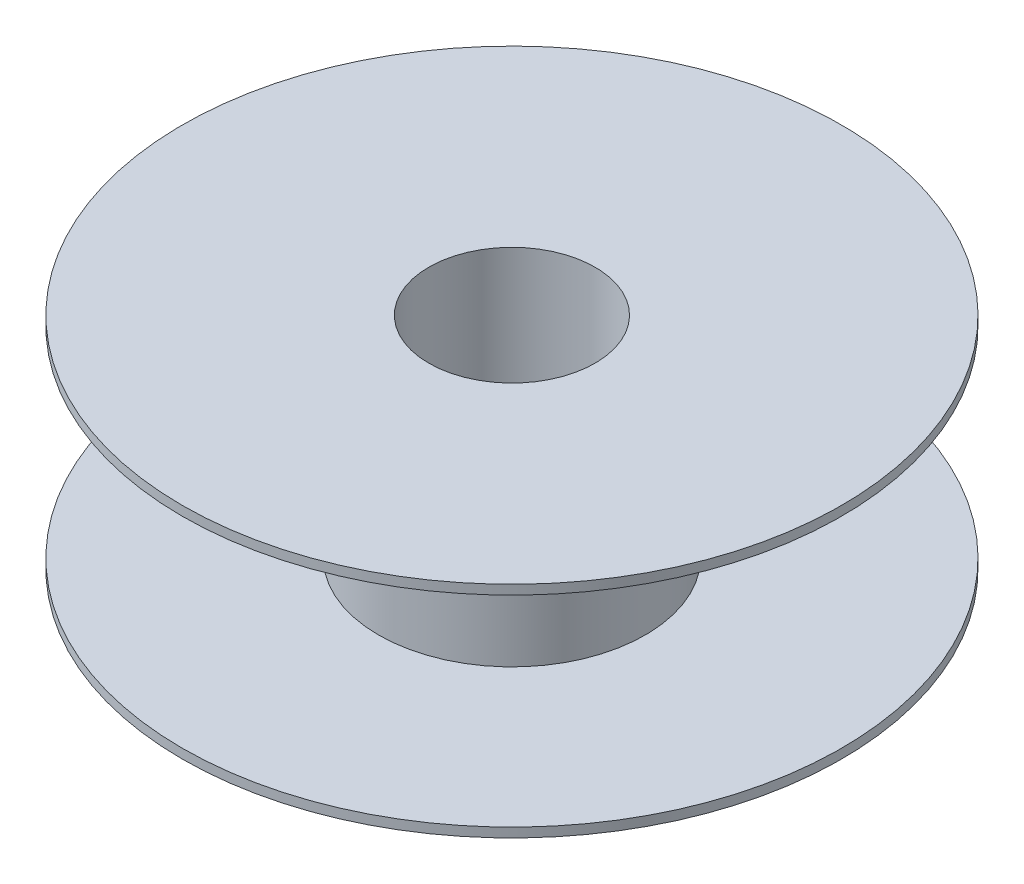
ISO-10303-21;
HEADER;
FILE_DESCRIPTION(('STEP AP214'),'2;1');
FILE_NAME('part.step','',(''),(''),'','','');
FILE_SCHEMA(('AUTOMOTIVE_DESIGN { 1 0 10303 214 1 1 1 1 }'));
ENDSEC;
DATA;
#1=APPLICATION_CONTEXT('core data for automotive mechanical design processes');
#2=APPLICATION_PROTOCOL_DEFINITION('international standard','automotive_design',2000,#1);
#3=PRODUCT_CONTEXT('',#1,'mechanical');
#4=PRODUCT('Part','Part','',(#3));
#5=PRODUCT_RELATED_PRODUCT_CATEGORY('part','',(#4));
#6=PRODUCT_DEFINITION_FORMATION('','',#4);
#7=PRODUCT_DEFINITION_CONTEXT('part definition',#1,'design');
#8=PRODUCT_DEFINITION('design','',#6,#7);
#9=PRODUCT_DEFINITION_SHAPE('','',#8);
#10=(LENGTH_UNIT() NAMED_UNIT(*) SI_UNIT(.MILLI.,.METRE.));
#11=(NAMED_UNIT(*) PLANE_ANGLE_UNIT() SI_UNIT($,.RADIAN.));
#12=(NAMED_UNIT(*) SI_UNIT($,.STERADIAN.) SOLID_ANGLE_UNIT());
#13=UNCERTAINTY_MEASURE_WITH_UNIT(LENGTH_MEASURE(1.E-05),#10,'distance_accuracy_value','');
#14=(GEOMETRIC_REPRESENTATION_CONTEXT(3) GLOBAL_UNCERTAINTY_ASSIGNED_CONTEXT((#13)) GLOBAL_UNIT_ASSIGNED_CONTEXT((#10,
#11,#12)) REPRESENTATION_CONTEXT('',''));
#15=CARTESIAN_POINT('',(0.,0.,0.));
#16=DIRECTION('',(0.,0.,1.));
#17=DIRECTION('',(1.,0.,0.));
#18=AXIS2_PLACEMENT_3D('',#15,#16,#17);
#19=CARTESIAN_POINT('',(105.,35.,0.));
#20=DIRECTION('',(0.,-1.,0.));
#21=DIRECTION('',(0.,0.,-1.));
#22=AXIS2_PLACEMENT_3D('',#19,#20,#21);
#23=PLANE('',#22);
#24=CARTESIAN_POINT('',(0.,35.,0.));
#25=DIRECTION('',(0.,1.,0.));
#26=DIRECTION('',(0.,0.,1.));
#27=AXIS2_PLACEMENT_3D('',#24,#25,#26);
#28=CIRCLE('',#27,26.5);
#29=CARTESIAN_POINT('',(0.,35.,26.5));
#30=VERTEX_POINT('',#29);
#31=EDGE_CURVE('E10',#30,#30,#28,.T.);
#32=ORIENTED_EDGE('',*,*,#31,.F.);
#33=EDGE_LOOP('',(#32));
#34=FACE_BOUND('',#33,.T.);
#35=CARTESIAN_POINT('',(0.,35.,0.));
#36=DIRECTION('',(0.,1.,0.));
#37=DIRECTION('',(0.,0.,1.));
#38=AXIS2_PLACEMENT_3D('',#35,#36,#37);
#39=CIRCLE('',#38,105.);
#40=CARTESIAN_POINT('',(0.,35.,105.));
#41=VERTEX_POINT('',#40);
#42=EDGE_CURVE('E59',#41,#41,#39,.T.);
#43=ORIENTED_EDGE('',*,*,#42,.T.);
#44=EDGE_LOOP('',(#43));
#45=FACE_BOUND('',#44,.T.);
#46=ADVANCED_FACE('F31',(#34,#45),#23,.F.);
#47=CARTESIAN_POINT('',(0.,23.2922302049293,0.));
#48=DIRECTION('',(0.,1.,0.));
#49=DIRECTION('',(0.,0.,1.));
#50=AXIS2_PLACEMENT_3D('',#47,#48,#49);
#51=CYLINDRICAL_SURFACE('',#50,26.5);
#52=CARTESIAN_POINT('',(0.,-35.,0.));
#53=DIRECTION('',(0.,1.,0.));
#54=DIRECTION('',(0.,0.,1.));
#55=AXIS2_PLACEMENT_3D('',#52,#53,#54);
#56=CIRCLE('',#55,26.5);
#57=CARTESIAN_POINT('',(0.,-35.,26.5));
#58=VERTEX_POINT('',#57);
#59=EDGE_CURVE('E37',#58,#58,#56,.T.);
#60=ORIENTED_EDGE('',*,*,#59,.F.);
#61=EDGE_LOOP('',(#60));
#62=FACE_BOUND('',#61,.T.);
#63=ORIENTED_EDGE('',*,*,#31,.T.);
#64=EDGE_LOOP('',(#63));
#65=FACE_BOUND('',#64,.T.);
#66=ADVANCED_FACE('F96',(#62,#65),#51,.F.);
#67=CARTESIAN_POINT('',(26.5,-35.,0.));
#68=DIRECTION('',(0.,1.,0.));
#69=DIRECTION('',(0.,0.,1.));
#70=AXIS2_PLACEMENT_3D('',#67,#68,#69);
#71=PLANE('',#70);
#72=CARTESIAN_POINT('',(0.,-35.,0.));
#73=DIRECTION('',(0.,1.,0.));
#74=DIRECTION('',(0.,0.,1.));
#75=AXIS2_PLACEMENT_3D('',#72,#73,#74);
#76=CIRCLE('',#75,105.);
#77=CARTESIAN_POINT('',(0.,-35.,105.));
#78=VERTEX_POINT('',#77);
#79=EDGE_CURVE('E41',#78,#78,#76,.T.);
#80=ORIENTED_EDGE('',*,*,#79,.F.);
#81=EDGE_LOOP('',(#80));
#82=FACE_BOUND('',#81,.T.);
#83=ORIENTED_EDGE('',*,*,#59,.T.);
#84=EDGE_LOOP('',(#83));
#85=FACE_BOUND('',#84,.T.);
#86=ADVANCED_FACE('F91',(#82,#85),#71,.F.);
#87=CARTESIAN_POINT('',(0.,23.2922302049293,0.));
#88=DIRECTION('',(0.,1.,0.));
#89=DIRECTION('',(0.,0.,1.));
#90=AXIS2_PLACEMENT_3D('',#87,#88,#89);
#91=CYLINDRICAL_SURFACE('',#90,105.);
#92=CARTESIAN_POINT('',(0.,-32.,0.));
#93=DIRECTION('',(0.,1.,0.));
#94=DIRECTION('',(0.,0.,1.));
#95=AXIS2_PLACEMENT_3D('',#92,#93,#94);
#96=CIRCLE('',#95,105.);
#97=CARTESIAN_POINT('',(0.,-32.,105.));
#98=VERTEX_POINT('',#97);
#99=EDGE_CURVE('E45',#98,#98,#96,.T.);
#100=ORIENTED_EDGE('',*,*,#99,.F.);
#101=EDGE_LOOP('',(#100));
#102=FACE_BOUND('',#101,.T.);
#103=ORIENTED_EDGE('',*,*,#79,.T.);
#104=EDGE_LOOP('',(#103));
#105=FACE_BOUND('',#104,.T.);
#106=ADVANCED_FACE('F85',(#102,#105),#91,.T.);
#107=CARTESIAN_POINT('',(105.,-32.,0.));
#108=DIRECTION('',(0.,-1.,0.));
#109=DIRECTION('',(0.,0.,-1.));
#110=AXIS2_PLACEMENT_3D('',#107,#108,#109);
#111=PLANE('',#110);
#112=CARTESIAN_POINT('',(0.,-32.,0.));
#113=DIRECTION('',(0.,1.,0.));
#114=DIRECTION('',(0.,0.,1.));
#115=AXIS2_PLACEMENT_3D('',#112,#113,#114);
#116=CIRCLE('',#115,42.5);
#117=CARTESIAN_POINT('',(0.,-32.,42.5));
#118=VERTEX_POINT('',#117);
#119=EDGE_CURVE('E50',#118,#118,#116,.T.);
#120=ORIENTED_EDGE('',*,*,#119,.F.);
#121=EDGE_LOOP('',(#120));
#122=FACE_BOUND('',#121,.T.);
#123=ORIENTED_EDGE('',*,*,#99,.T.);
#124=EDGE_LOOP('',(#123));
#125=FACE_BOUND('',#124,.T.);
#126=ADVANCED_FACE('F79',(#122,#125),#111,.F.);
#127=CARTESIAN_POINT('',(0.,23.2922302049293,0.));
#128=DIRECTION('',(0.,1.,0.));
#129=DIRECTION('',(0.,0.,1.));
#130=AXIS2_PLACEMENT_3D('',#127,#128,#129);
#131=CYLINDRICAL_SURFACE('',#130,42.5);
#132=CARTESIAN_POINT('',(0.,32.,0.));
#133=DIRECTION('',(0.,1.,0.));
#134=DIRECTION('',(0.,0.,1.));
#135=AXIS2_PLACEMENT_3D('',#132,#133,#134);
#136=CIRCLE('',#135,42.5);
#137=CARTESIAN_POINT('',(0.,32.,42.5));
#138=VERTEX_POINT('',#137);
#139=EDGE_CURVE('E53',#138,#138,#136,.T.);
#140=ORIENTED_EDGE('',*,*,#139,.F.);
#141=EDGE_LOOP('',(#140));
#142=FACE_BOUND('',#141,.T.);
#143=ORIENTED_EDGE('',*,*,#119,.T.);
#144=EDGE_LOOP('',(#143));
#145=FACE_BOUND('',#144,.T.);
#146=ADVANCED_FACE('F73',(#142,#145),#131,.T.);
#147=CARTESIAN_POINT('',(42.5,32.,0.));
#148=DIRECTION('',(0.,1.,0.));
#149=DIRECTION('',(0.,0.,1.));
#150=AXIS2_PLACEMENT_3D('',#147,#148,#149);
#151=PLANE('',#150);
#152=CARTESIAN_POINT('',(0.,32.,0.));
#153=DIRECTION('',(0.,1.,0.));
#154=DIRECTION('',(0.,0.,1.));
#155=AXIS2_PLACEMENT_3D('',#152,#153,#154);
#156=CIRCLE('',#155,105.);
#157=CARTESIAN_POINT('',(0.,32.,105.));
#158=VERTEX_POINT('',#157);
#159=EDGE_CURVE('E56',#158,#158,#156,.T.);
#160=ORIENTED_EDGE('',*,*,#159,.F.);
#161=EDGE_LOOP('',(#160));
#162=FACE_BOUND('',#161,.T.);
#163=ORIENTED_EDGE('',*,*,#139,.T.);
#164=EDGE_LOOP('',(#163));
#165=FACE_BOUND('',#164,.T.);
#166=ADVANCED_FACE('F67',(#162,#165),#151,.F.);
#167=CARTESIAN_POINT('',(0.,23.2922302049293,0.));
#168=DIRECTION('',(0.,1.,0.));
#169=DIRECTION('',(0.,0.,1.));
#170=AXIS2_PLACEMENT_3D('',#167,#168,#169);
#171=CYLINDRICAL_SURFACE('',#170,105.);
#172=ORIENTED_EDGE('',*,*,#42,.F.);
#173=EDGE_LOOP('',(#172));
#174=FACE_BOUND('',#173,.T.);
#175=ORIENTED_EDGE('',*,*,#159,.T.);
#176=EDGE_LOOP('',(#175));
#177=FACE_BOUND('',#176,.T.);
#178=ADVANCED_FACE('F64',(#174,#177),#171,.T.);
#179=CLOSED_SHELL('',(#46,#66,#86,#106,#126,#146,#166,#178));
#180=MANIFOLD_SOLID_BREP('B2',#179);
#181=ADVANCED_BREP_SHAPE_REPRESENTATION('',(#18,#180),#14);
#182=SHAPE_DEFINITION_REPRESENTATION(#9,#181);
ENDSEC;
END-ISO-10303-21;
